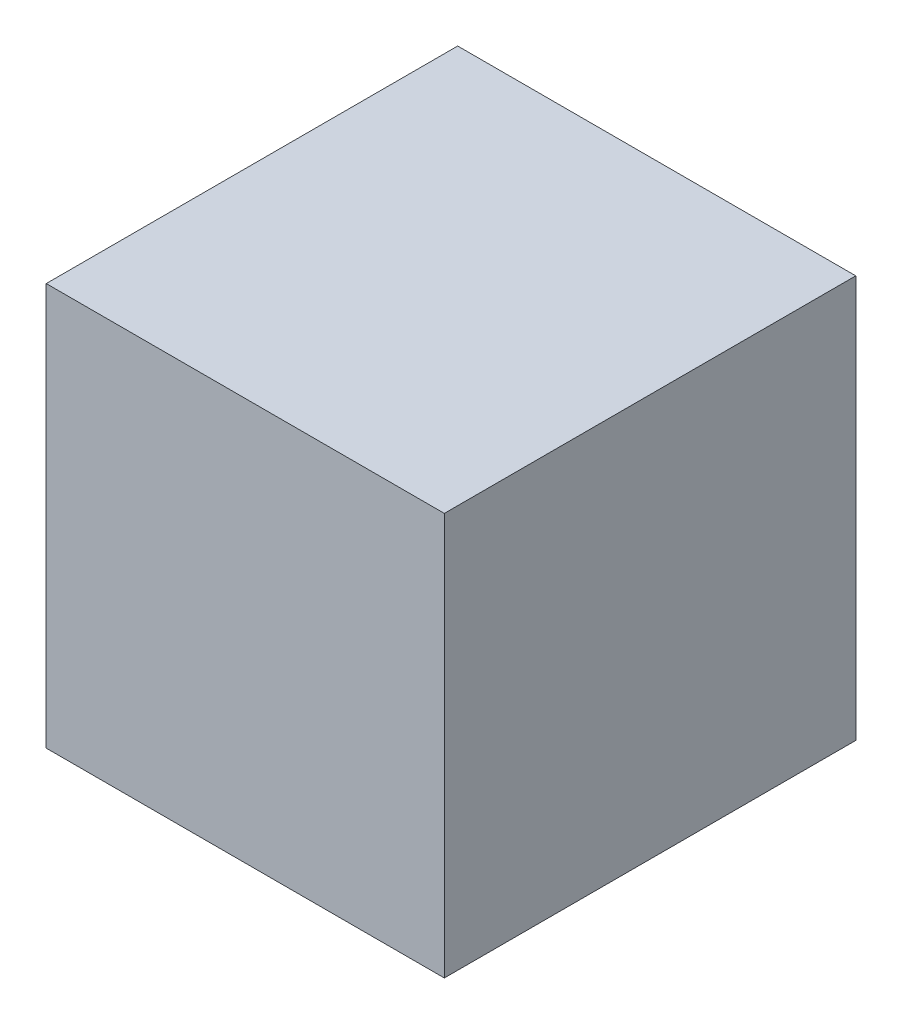
ISO-10303-21;
HEADER;
FILE_DESCRIPTION(('STEP AP214'),'2;1');
FILE_NAME('part.step','',(''),(''),'','','');
FILE_SCHEMA(('AUTOMOTIVE_DESIGN { 1 0 10303 214 1 1 1 1 }'));
ENDSEC;
DATA;
#1=APPLICATION_CONTEXT('core data for automotive mechanical design processes');
#2=APPLICATION_PROTOCOL_DEFINITION('international standard','automotive_design',2000,#1);
#3=PRODUCT_CONTEXT('',#1,'mechanical');
#4=PRODUCT('Part','Part','',(#3));
#5=PRODUCT_RELATED_PRODUCT_CATEGORY('part','',(#4));
#6=PRODUCT_DEFINITION_FORMATION('','',#4);
#7=PRODUCT_DEFINITION_CONTEXT('part definition',#1,'design');
#8=PRODUCT_DEFINITION('design','',#6,#7);
#9=PRODUCT_DEFINITION_SHAPE('','',#8);
#10=(LENGTH_UNIT() NAMED_UNIT(*) SI_UNIT(.MILLI.,.METRE.));
#11=(NAMED_UNIT(*) PLANE_ANGLE_UNIT() SI_UNIT($,.RADIAN.));
#12=(NAMED_UNIT(*) SI_UNIT($,.STERADIAN.) SOLID_ANGLE_UNIT());
#13=UNCERTAINTY_MEASURE_WITH_UNIT(LENGTH_MEASURE(1.E-05),#10,'distance_accuracy_value','');
#14=(GEOMETRIC_REPRESENTATION_CONTEXT(3) GLOBAL_UNCERTAINTY_ASSIGNED_CONTEXT((#13)) GLOBAL_UNIT_ASSIGNED_CONTEXT((#10,
#11,#12)) REPRESENTATION_CONTEXT('',''));
#15=CARTESIAN_POINT('',(0.,0.,0.));
#16=DIRECTION('',(0.,0.,1.));
#17=DIRECTION('',(1.,0.,0.));
#18=AXIS2_PLACEMENT_3D('',#15,#16,#17);
#19=CARTESIAN_POINT('',(-78.7240251572327,38.,-35.1987227866473));
#20=DIRECTION('',(1.,0.,0.));
#21=DIRECTION('',(0.,0.,-1.));
#22=AXIS2_PLACEMENT_3D('',#19,#20,#21);
#23=PLANE('',#22);
#24=DIRECTION('',(0.,0.,1.));
#25=VECTOR('',#24,1.);
#26=CARTESIAN_POINT('',(-78.7240251572327,0.,-35.1987227866473));
#27=LINE('',#26,#25);
#28=CARTESIAN_POINT('',(-78.7240251572327,0.,-35.1987227866473));
#29=VERTEX_POINT('',#28);
#30=CARTESIAN_POINT('',(-78.7240251572327,0.,3.65864860506371));
#31=VERTEX_POINT('',#30);
#32=EDGE_CURVE('E98',#29,#31,#27,.T.);
#33=ORIENTED_EDGE('',*,*,#32,.T.);
#34=DIRECTION('',(0.,-1.,0.));
#35=VECTOR('',#34,1.);
#36=CARTESIAN_POINT('',(-78.7240251572327,38.,3.65864860506371));
#37=LINE('',#36,#35);
#38=CARTESIAN_POINT('',(-78.7240251572327,38.,3.65864860506371));
#39=VERTEX_POINT('',#38);
#40=EDGE_CURVE('E11',#39,#31,#37,.T.);
#41=ORIENTED_EDGE('',*,*,#40,.F.);
#42=DIRECTION('',(0.,0.,1.));
#43=VECTOR('',#42,1.);
#44=CARTESIAN_POINT('',(-78.7240251572327,38.,-35.1987227866473));
#45=LINE('',#44,#43);
#46=CARTESIAN_POINT('',(-78.7240251572327,38.,-35.1987227866473));
#47=VERTEX_POINT('',#46);
#48=EDGE_CURVE('E86',#47,#39,#45,.T.);
#49=ORIENTED_EDGE('',*,*,#48,.F.);
#50=DIRECTION('',(0.,-1.,0.));
#51=VECTOR('',#50,1.);
#52=CARTESIAN_POINT('',(-78.7240251572327,38.,-35.1987227866473));
#53=LINE('',#52,#51);
#54=EDGE_CURVE('E94',#47,#29,#53,.T.);
#55=ORIENTED_EDGE('',*,*,#54,.T.);
#56=EDGE_LOOP('',(#33,#41,#49,#55));
#57=FACE_BOUND('',#56,.T.);
#58=ADVANCED_FACE('F35',(#57),#23,.F.);
#59=CARTESIAN_POINT('',(-78.7240251572327,38.,3.65864860506371));
#60=DIRECTION('',(0.,0.,-1.));
#61=DIRECTION('',(-1.,0.,0.));
#62=AXIS2_PLACEMENT_3D('',#59,#60,#61);
#63=PLANE('',#62);
#64=DIRECTION('',(1.,0.,0.));
#65=VECTOR('',#64,1.);
#66=CARTESIAN_POINT('',(-78.7240251572327,0.,3.65864860506371));
#67=LINE('',#66,#65);
#68=CARTESIAN_POINT('',(-41.128256732785,0.,3.65864860506371));
#69=VERTEX_POINT('',#68);
#70=EDGE_CURVE('E90',#31,#69,#67,.T.);
#71=ORIENTED_EDGE('',*,*,#70,.T.);
#72=DIRECTION('',(0.,-1.,0.));
#73=VECTOR('',#72,1.);
#74=CARTESIAN_POINT('',(-41.128256732785,38.,3.65864860506371));
#75=LINE('',#74,#73);
#76=CARTESIAN_POINT('',(-41.128256732785,38.,3.65864860506371));
#77=VERTEX_POINT('',#76);
#78=EDGE_CURVE('E43',#77,#69,#75,.T.);
#79=ORIENTED_EDGE('',*,*,#78,.F.);
#80=DIRECTION('',(1.,0.,0.));
#81=VECTOR('',#80,1.);
#82=CARTESIAN_POINT('',(-78.7240251572327,38.,3.65864860506371));
#83=LINE('',#82,#81);
#84=EDGE_CURVE('E81',#39,#77,#83,.T.);
#85=ORIENTED_EDGE('',*,*,#84,.F.);
#86=ORIENTED_EDGE('',*,*,#40,.T.);
#87=EDGE_LOOP('',(#71,#79,#85,#86));
#88=FACE_BOUND('',#87,.T.);
#89=ADVANCED_FACE('F89',(#88),#63,.F.);
#90=CARTESIAN_POINT('',(-41.128256732785,38.,-35.1987227866473));
#91=DIRECTION('',(-1.,0.,0.));
#92=DIRECTION('',(0.,0.,1.));
#93=AXIS2_PLACEMENT_3D('',#90,#91,#92);
#94=PLANE('',#93);
#95=DIRECTION('',(0.,0.,-1.));
#96=VECTOR('',#95,1.);
#97=CARTESIAN_POINT('',(-41.128256732785,0.,-35.1987227866473));
#98=LINE('',#97,#96);
#99=CARTESIAN_POINT('',(-41.128256732785,0.,-35.1987227866473));
#100=VERTEX_POINT('',#99);
#101=EDGE_CURVE('E68',#69,#100,#98,.T.);
#102=ORIENTED_EDGE('',*,*,#101,.T.);
#103=DIRECTION('',(0.,-1.,0.));
#104=VECTOR('',#103,1.);
#105=CARTESIAN_POINT('',(-41.128256732785,38.,-35.1987227866473));
#106=LINE('',#105,#104);
#107=CARTESIAN_POINT('',(-41.128256732785,38.,-35.1987227866473));
#108=VERTEX_POINT('',#107);
#109=EDGE_CURVE('E91',#108,#100,#106,.T.);
#110=ORIENTED_EDGE('',*,*,#109,.F.);
#111=DIRECTION('',(0.,0.,-1.));
#112=VECTOR('',#111,1.);
#113=CARTESIAN_POINT('',(-41.128256732785,38.,-35.1987227866473));
#114=LINE('',#113,#112);
#115=EDGE_CURVE('E84',#77,#108,#114,.T.);
#116=ORIENTED_EDGE('',*,*,#115,.F.);
#117=ORIENTED_EDGE('',*,*,#78,.T.);
#118=EDGE_LOOP('',(#102,#110,#116,#117));
#119=FACE_BOUND('',#118,.T.);
#120=ADVANCED_FACE('F92',(#119),#94,.F.);
#121=CARTESIAN_POINT('',(-78.7240251572327,38.,-35.1987227866473));
#122=DIRECTION('',(0.,0.,1.));
#123=DIRECTION('',(1.,0.,0.));
#124=AXIS2_PLACEMENT_3D('',#121,#122,#123);
#125=PLANE('',#124);
#126=DIRECTION('',(-1.,0.,0.));
#127=VECTOR('',#126,1.);
#128=CARTESIAN_POINT('',(-78.7240251572327,0.,-35.1987227866473));
#129=LINE('',#128,#127);
#130=EDGE_CURVE('E74',#100,#29,#129,.T.);
#131=ORIENTED_EDGE('',*,*,#130,.T.);
#132=ORIENTED_EDGE('',*,*,#54,.F.);
#133=DIRECTION('',(-1.,0.,0.));
#134=VECTOR('',#133,1.);
#135=CARTESIAN_POINT('',(-78.7240251572327,38.,-35.1987227866473));
#136=LINE('',#135,#134);
#137=EDGE_CURVE('E51',#108,#47,#136,.T.);
#138=ORIENTED_EDGE('',*,*,#137,.F.);
#139=ORIENTED_EDGE('',*,*,#109,.T.);
#140=EDGE_LOOP('',(#131,#132,#138,#139));
#141=FACE_BOUND('',#140,.T.);
#142=ADVANCED_FACE('F105',(#141),#125,.F.);
#143=CARTESIAN_POINT('',(0.,38.,0.));
#144=DIRECTION('',(0.,1.,0.));
#145=DIRECTION('',(0.,0.,1.));
#146=AXIS2_PLACEMENT_3D('',#143,#144,#145);
#147=PLANE('',#146);
#148=ORIENTED_EDGE('',*,*,#48,.T.);
#149=ORIENTED_EDGE('',*,*,#84,.T.);
#150=ORIENTED_EDGE('',*,*,#115,.T.);
#151=ORIENTED_EDGE('',*,*,#137,.T.);
#152=EDGE_LOOP('',(#148,#149,#150,#151));
#153=FACE_BOUND('',#152,.T.);
#154=ADVANCED_FACE('F82',(#153),#147,.T.);
#155=CARTESIAN_POINT('',(0.,0.,0.));
#156=DIRECTION('',(0.,1.,0.));
#157=DIRECTION('',(0.,0.,1.));
#158=AXIS2_PLACEMENT_3D('',#155,#156,#157);
#159=PLANE('',#158);
#160=ORIENTED_EDGE('',*,*,#32,.F.);
#161=ORIENTED_EDGE('',*,*,#130,.F.);
#162=ORIENTED_EDGE('',*,*,#101,.F.);
#163=ORIENTED_EDGE('',*,*,#70,.F.);
#164=EDGE_LOOP('',(#160,#161,#162,#163));
#165=FACE_BOUND('',#164,.T.);
#166=ADVANCED_FACE('F108',(#165),#159,.F.);
#167=CLOSED_SHELL('',(#58,#89,#120,#142,#154,#166));
#168=MANIFOLD_SOLID_BREP('B2',#167);
#169=ADVANCED_BREP_SHAPE_REPRESENTATION('',(#18,#168),#14);
#170=SHAPE_DEFINITION_REPRESENTATION(#9,#169);
ENDSEC;
END-ISO-10303-21;
